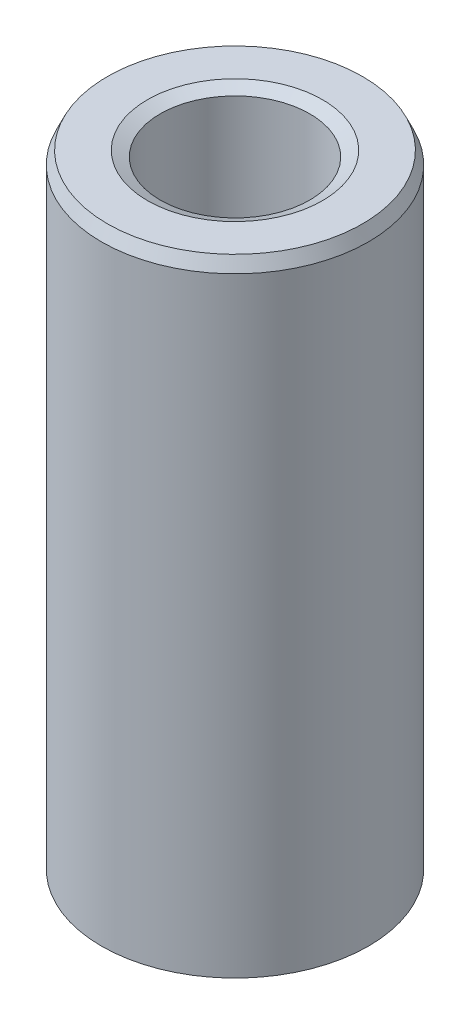
ISO-10303-21;
HEADER;
FILE_DESCRIPTION(('STEP AP214'),'2;1');
FILE_NAME('part.step','',(''),(''),'','','');
FILE_SCHEMA(('AUTOMOTIVE_DESIGN { 1 0 10303 214 1 1 1 1 }'));
ENDSEC;
DATA;
#1=APPLICATION_CONTEXT('core data for automotive mechanical design processes');
#2=APPLICATION_PROTOCOL_DEFINITION('international standard','automotive_design',2000,#1);
#3=PRODUCT_CONTEXT('',#1,'mechanical');
#4=PRODUCT('Part','Part','',(#3));
#5=PRODUCT_RELATED_PRODUCT_CATEGORY('part','',(#4));
#6=PRODUCT_DEFINITION_FORMATION('','',#4);
#7=PRODUCT_DEFINITION_CONTEXT('part definition',#1,'design');
#8=PRODUCT_DEFINITION('design','',#6,#7);
#9=PRODUCT_DEFINITION_SHAPE('','',#8);
#10=(LENGTH_UNIT() NAMED_UNIT(*) SI_UNIT(.MILLI.,.METRE.));
#11=(NAMED_UNIT(*) PLANE_ANGLE_UNIT() SI_UNIT($,.RADIAN.));
#12=(NAMED_UNIT(*) SI_UNIT($,.STERADIAN.) SOLID_ANGLE_UNIT());
#13=UNCERTAINTY_MEASURE_WITH_UNIT(LENGTH_MEASURE(1.E-05),#10,'distance_accuracy_value','');
#14=(GEOMETRIC_REPRESENTATION_CONTEXT(3) GLOBAL_UNCERTAINTY_ASSIGNED_CONTEXT((#13)) GLOBAL_UNIT_ASSIGNED_CONTEXT((#10,
#11,#12)) REPRESENTATION_CONTEXT('',''));
#15=CARTESIAN_POINT('',(0.,0.,0.));
#16=DIRECTION('',(0.,0.,1.));
#17=DIRECTION('',(1.,0.,0.));
#18=AXIS2_PLACEMENT_3D('',#15,#16,#17);
#19=CARTESIAN_POINT('',(0.,94.1859412438333,0.));
#20=DIRECTION('',(0.,-1.,0.));
#21=DIRECTION('',(0.,0.,-1.));
#22=AXIS2_PLACEMENT_3D('',#19,#20,#21);
#23=CYLINDRICAL_SURFACE('',#22,20.);
#24=CARTESIAN_POINT('',(0.,0.878231751337652,0.));
#25=DIRECTION('',(0.,1.,0.));
#26=DIRECTION('',(0.,0.,1.));
#27=AXIS2_PLACEMENT_3D('',#24,#25,#26);
#28=CIRCLE('',#27,20.);
#29=CARTESIAN_POINT('',(0.,0.878231751337652,20.));
#30=VERTEX_POINT('',#29);
#31=EDGE_CURVE('E10',#30,#30,#28,.T.);
#32=ORIENTED_EDGE('',*,*,#31,.T.);
#33=EDGE_LOOP('',(#32));
#34=FACE_BOUND('',#33,.T.);
#35=CARTESIAN_POINT('',(0.,92.2778141694954,0.));
#36=DIRECTION('',(0.,1.,0.));
#37=DIRECTION('',(0.,0.,1.));
#38=AXIS2_PLACEMENT_3D('',#35,#36,#37);
#39=CIRCLE('',#38,20.);
#40=CARTESIAN_POINT('',(0.,92.2778141694954,-20.));
#41=VERTEX_POINT('',#40);
#42=EDGE_CURVE('E50',#41,#41,#39,.F.);
#43=ORIENTED_EDGE('',*,*,#42,.T.);
#44=EDGE_LOOP('',(#43));
#45=FACE_BOUND('',#44,.T.);
#46=ADVANCED_FACE('F39',(#34,#45),#23,.T.);
#47=CARTESIAN_POINT('',(0.,94.1859412438333,0.));
#48=DIRECTION('',(0.,1.,0.));
#49=DIRECTION('',(0.,0.,1.));
#50=AXIS2_PLACEMENT_3D('',#47,#48,#49);
#51=PLANE('',#50);
#52=CARTESIAN_POINT('',(0.,94.1859412438333,0.));
#53=DIRECTION('',(0.,1.,0.));
#54=DIRECTION('',(0.,0.,1.));
#55=AXIS2_PLACEMENT_3D('',#52,#53,#54);
#56=CIRCLE('',#55,13.1146865611089);
#57=CARTESIAN_POINT('',(0.,94.1859412438333,13.1146865611089));
#58=VERTEX_POINT('',#57);
#59=EDGE_CURVE('E58',#58,#58,#56,.F.);
#60=ORIENTED_EDGE('',*,*,#59,.T.);
#61=EDGE_LOOP('',(#60));
#62=FACE_BOUND('',#61,.T.);
#63=CARTESIAN_POINT('',(0.,94.1859412438333,0.));
#64=DIRECTION('',(0.,1.,0.));
#65=DIRECTION('',(0.,0.,1.));
#66=AXIS2_PLACEMENT_3D('',#63,#64,#65);
#67=CIRCLE('',#66,19.1217682486623);
#68=CARTESIAN_POINT('',(0.,94.1859412438333,-19.1217682486623));
#69=VERTEX_POINT('',#68);
#70=EDGE_CURVE('E61',#69,#69,#67,.T.);
#71=ORIENTED_EDGE('',*,*,#70,.T.);
#72=EDGE_LOOP('',(#71));
#73=FACE_BOUND('',#72,.T.);
#74=ADVANCED_FACE('F88',(#62,#73),#51,.T.);
#75=CARTESIAN_POINT('',(0.,0.,0.));
#76=DIRECTION('',(0.,1.,0.));
#77=DIRECTION('',(0.,0.,1.));
#78=AXIS2_PLACEMENT_3D('',#75,#76,#77);
#79=PLANE('',#78);
#80=CARTESIAN_POINT('',(0.,0.,0.));
#81=DIRECTION('',(0.,1.,0.));
#82=DIRECTION('',(0.,0.,1.));
#83=AXIS2_PLACEMENT_3D('',#80,#81,#82);
#84=CIRCLE('',#83,12.0847912381087);
#85=CARTESIAN_POINT('',(0.,0.,12.0847912381087));
#86=VERTEX_POINT('',#85);
#87=EDGE_CURVE('E51',#86,#86,#84,.T.);
#88=ORIENTED_EDGE('',*,*,#87,.T.);
#89=EDGE_LOOP('',(#88));
#90=FACE_BOUND('',#89,.T.);
#91=CARTESIAN_POINT('',(0.,0.,0.));
#92=DIRECTION('',(0.,1.,0.));
#93=DIRECTION('',(0.,0.,1.));
#94=AXIS2_PLACEMENT_3D('',#91,#92,#93);
#95=CIRCLE('',#94,18.0918729256622);
#96=CARTESIAN_POINT('',(0.,0.,18.0918729256622));
#97=VERTEX_POINT('',#96);
#98=EDGE_CURVE('E54',#97,#97,#95,.F.);
#99=ORIENTED_EDGE('',*,*,#98,.T.);
#100=EDGE_LOOP('',(#99));
#101=FACE_BOUND('',#100,.T.);
#102=ADVANCED_FACE('F83',(#90,#101),#79,.F.);
#103=CARTESIAN_POINT('',(0.,94.1859412438333,0.));
#104=DIRECTION('',(0.,-1.,0.));
#105=DIRECTION('',(0.,0.,-1.));
#106=AXIS2_PLACEMENT_3D('',#103,#104,#105);
#107=CYLINDRICAL_SURFACE('',#106,11.206559486771);
#108=CARTESIAN_POINT('',(0.,93.3077094924957,0.));
#109=DIRECTION('',(0.,1.,0.));
#110=DIRECTION('',(0.,0.,1.));
#111=AXIS2_PLACEMENT_3D('',#108,#109,#110);
#112=CIRCLE('',#111,11.206559486771);
#113=CARTESIAN_POINT('',(0.,93.3077094924957,11.206559486771));
#114=VERTEX_POINT('',#113);
#115=EDGE_CURVE('E67',#114,#114,#112,.T.);
#116=ORIENTED_EDGE('',*,*,#115,.T.);
#117=EDGE_LOOP('',(#116));
#118=FACE_BOUND('',#117,.T.);
#119=CARTESIAN_POINT('',(0.,1.90812707433788,0.));
#120=DIRECTION('',(0.,1.,0.));
#121=DIRECTION('',(0.,0.,1.));
#122=AXIS2_PLACEMENT_3D('',#119,#120,#121);
#123=CIRCLE('',#122,11.206559486771);
#124=CARTESIAN_POINT('',(0.,1.90812707433788,11.206559486771));
#125=VERTEX_POINT('',#124);
#126=EDGE_CURVE('E69',#125,#125,#123,.F.);
#127=ORIENTED_EDGE('',*,*,#126,.T.);
#128=EDGE_LOOP('',(#127));
#129=FACE_BOUND('',#128,.T.);
#130=ADVANCED_FACE('F71',(#118,#129),#107,.F.);
#131=CARTESIAN_POINT('',(0.,93.3077094924957,0.));
#132=DIRECTION('',(0.,1.,0.));
#133=DIRECTION('',(0.,0.,1.));
#134=AXIS2_PLACEMENT_3D('',#131,#132,#133);
#135=CONICAL_SURFACE('',#134,11.206559486771,1.13944423275398);
#136=ORIENTED_EDGE('',*,*,#59,.F.);
#137=EDGE_LOOP('',(#136));
#138=FACE_BOUND('',#137,.T.);
#139=ORIENTED_EDGE('',*,*,#115,.F.);
#140=EDGE_LOOP('',(#139));
#141=FACE_BOUND('',#140,.T.);
#142=ADVANCED_FACE('F77',(#138,#141),#135,.F.);
#143=CARTESIAN_POINT('',(0.,0.,0.));
#144=DIRECTION('',(0.,-1.,0.));
#145=DIRECTION('',(0.,0.,-1.));
#146=AXIS2_PLACEMENT_3D('',#143,#144,#145);
#147=CONICAL_SURFACE('',#146,12.0847912381087,0.43135209404091);
#148=ORIENTED_EDGE('',*,*,#126,.F.);
#149=EDGE_LOOP('',(#148));
#150=FACE_BOUND('',#149,.T.);
#151=ORIENTED_EDGE('',*,*,#87,.F.);
#152=EDGE_LOOP('',(#151));
#153=FACE_BOUND('',#152,.T.);
#154=ADVANCED_FACE('F73',(#150,#153),#147,.F.);
#155=CARTESIAN_POINT('',(0.,0.878231751337652,0.));
#156=DIRECTION('',(0.,1.,0.));
#157=DIRECTION('',(0.,0.,1.));
#158=AXIS2_PLACEMENT_3D('',#155,#156,#157);
#159=CONICAL_SURFACE('',#158,20.,1.13944423275399);
#160=ORIENTED_EDGE('',*,*,#98,.F.);
#161=EDGE_LOOP('',(#160));
#162=FACE_BOUND('',#161,.T.);
#163=ORIENTED_EDGE('',*,*,#31,.F.);
#164=EDGE_LOOP('',(#163));
#165=FACE_BOUND('',#164,.T.);
#166=ADVANCED_FACE('F76',(#162,#165),#159,.T.);
#167=CARTESIAN_POINT('',(0.,94.1859412438333,0.));
#168=DIRECTION('',(0.,-1.,0.));
#169=DIRECTION('',(0.,0.,-1.));
#170=AXIS2_PLACEMENT_3D('',#167,#168,#169);
#171=CONICAL_SURFACE('',#170,19.1217682486623,0.431352094040906);
#172=CARTESIAN_POINT('',(0.,92.2778141694954,-20.));
#173=CARTESIAN_POINT('',(0.,92.2976904931864,-19.9908517525902));
#174=CARTESIAN_POINT('',(0.,92.3175668168775,-19.9817035051805));
#175=CARTESIAN_POINT('',(0.,92.3573194642595,-19.9634070103609));
#176=CARTESIAN_POINT('',(0.,92.3771957879505,-19.9542587629512));
#177=CARTESIAN_POINT('',(0.,92.4169484353326,-19.9359622681316));
#178=CARTESIAN_POINT('',(0.,92.4368247590236,-19.9268140207219));
#179=CARTESIAN_POINT('',(0.,92.4765774064056,-19.9085175259023));
#180=CARTESIAN_POINT('',(0.,92.4964537300966,-19.8993692784926));
#181=CARTESIAN_POINT('',(0.,92.5362063774787,-19.881072783673));
#182=CARTESIAN_POINT('',(0.,92.5560827011697,-19.8719245362633));
#183=CARTESIAN_POINT('',(0.,92.5958353485517,-19.8536280414437));
#184=CARTESIAN_POINT('',(0.,92.6157116722428,-19.844479794034));
#185=CARTESIAN_POINT('',(0.,92.6554643196248,-19.8261832992144));
#186=CARTESIAN_POINT('',(0.,92.6753406433158,-19.8170350518047));
#187=CARTESIAN_POINT('',(0.,92.7150932906979,-19.7987385569851));
#188=CARTESIAN_POINT('',(0.,92.7349696143889,-19.7895903095754));
#189=CARTESIAN_POINT('',(0.,92.7747222617709,-19.7712938147558));
#190=CARTESIAN_POINT('',(0.,92.7945985854619,-19.7621455673461));
#191=CARTESIAN_POINT('',(0.,92.834351232844,-19.7438490725265));
#192=CARTESIAN_POINT('',(0.,92.854227556535,-19.7347008251168));
#193=CARTESIAN_POINT('',(0.,92.893980203917,-19.7164043302972));
#194=CARTESIAN_POINT('',(0.,92.9138565276081,-19.7072560828875));
#195=CARTESIAN_POINT('',(0.,92.9536091749901,-19.6889595880679));
#196=CARTESIAN_POINT('',(0.,92.9734854986811,-19.6798113406581));
#197=CARTESIAN_POINT('',(0.,93.0132381460632,-19.6615148458386));
#198=CARTESIAN_POINT('',(0.,93.0331144697542,-19.6523665984288));
#199=CARTESIAN_POINT('',(0.,93.0728671171362,-19.6340701036093));
#200=CARTESIAN_POINT('',(0.,93.0927434408272,-19.6249218561995));
#201=CARTESIAN_POINT('',(0.,93.1324960882093,-19.60662536138));
#202=CARTESIAN_POINT('',(0.,93.1523724119003,-19.5974771139702));
#203=CARTESIAN_POINT('',(0.,93.1921250592823,-19.5791806191507));
#204=CARTESIAN_POINT('',(0.,93.2120013829734,-19.5700323717409));
#205=CARTESIAN_POINT('',(0.,93.2517540303554,-19.5517358769214));
#206=CARTESIAN_POINT('',(0.,93.2716303540464,-19.5425876295116));
#207=CARTESIAN_POINT('',(0.,93.3113830014285,-19.5242911346921));
#208=CARTESIAN_POINT('',(0.,93.3312593251195,-19.5151428872823));
#209=CARTESIAN_POINT('',(0.,93.3710119725015,-19.4968463924628));
#210=CARTESIAN_POINT('',(0.,93.3908882961925,-19.487698145053));
#211=CARTESIAN_POINT('',(0.,93.4306409435746,-19.4694016502335));
#212=CARTESIAN_POINT('',(0.,93.4505172672656,-19.4602534028237));
#213=CARTESIAN_POINT('',(0.,93.4902699146476,-19.4419569080042));
#214=CARTESIAN_POINT('',(0.,93.5101462383386,-19.4328086605944));
#215=CARTESIAN_POINT('',(0.,93.5498988857207,-19.4145121657749));
#216=CARTESIAN_POINT('',(0.,93.5697752094117,-19.4053639183651));
#217=CARTESIAN_POINT('',(0.,93.6095278567937,-19.3870674235456));
#218=CARTESIAN_POINT('',(0.,93.6294041804848,-19.3779191761358));
#219=CARTESIAN_POINT('',(0.,93.6691568278668,-19.3596226813163));
#220=CARTESIAN_POINT('',(0.,93.6890331515578,-19.3504744339065));
#221=CARTESIAN_POINT('',(0.,93.7287857989399,-19.332177939087));
#222=CARTESIAN_POINT('',(0.,93.7486621226309,-19.3230296916772));
#223=CARTESIAN_POINT('',(0.,93.7884147700129,-19.3047331968577));
#224=CARTESIAN_POINT('',(0.,93.8082910937039,-19.2955849494479));
#225=CARTESIAN_POINT('',(0.,93.848043741086,-19.2772884546284));
#226=CARTESIAN_POINT('',(0.,93.867920064777,-19.2681402072186));
#227=CARTESIAN_POINT('',(0.,93.907672712159,-19.2498437123991));
#228=CARTESIAN_POINT('',(0.,93.9275490358501,-19.2406954649893));
#229=CARTESIAN_POINT('',(0.,93.9673016832321,-19.2223989701698));
#230=CARTESIAN_POINT('',(0.,93.9871780069231,-19.21325072276));
#231=CARTESIAN_POINT('',(0.,94.0269306543052,-19.1949542279405));
#232=CARTESIAN_POINT('',(0.,94.0468069779962,-19.1858059805307));
#233=CARTESIAN_POINT('',(0.,94.0865596253782,-19.1675094857112));
#234=CARTESIAN_POINT('',(0.,94.1064359490692,-19.1583612383014));
#235=CARTESIAN_POINT('',(0.,94.1461885964513,-19.1400647434819));
#236=CARTESIAN_POINT('',(0.,94.1660649201423,-19.1309164960721));
#237=CARTESIAN_POINT('',(0.,94.1859412438333,-19.1217682486623));
#238=B_SPLINE_CURVE_WITH_KNOTS('',3,(#172,#173,#174,#175,#176,#177,#178,#179,#180,#181,#182,
#183,#184,#185,#186,#187,#188,#189,#190,#191,#192,#193,#194,#195,#196,#197,#198,#199,#200,#201,
#202,#203,#204,#205,#206,#207,#208,#209,#210,#211,#212,#213,#214,#215,#216,#217,#218,#219,#220,
#221,#222,#223,#224,#225,#226,#227,#228,#229,#230,#231,#232,#233,#234,#235,#236,#237),
.UNSPECIFIED.,.F.,.F.,(4,2,2,2,2,2,2,2,2,2,2,2,2,2,2,2,2,2,2,2,2,2,2,2,2,2,2,2,2,2,2,2,4),(0.,
0.0656416641110257,0.131283328222053,0.196924992333079,0.262566656444106,0.328208320555131,
0.393849984666159,0.459491648777172,0.525133312888199,0.590774976999225,0.656416641110252,
0.722058305221278,0.787699969332305,0.853341633443318,0.918983297554345,0.984624961665371,
1.0502666257764,1.11590828988742,1.18154995399845,1.24719161810948,1.31283328222049,
1.37847494633152,1.44411661044254,1.50975827455357,1.5753999386646,1.64104160277562,
1.70668326688664,1.77232493099766,1.83796659510869,1.90360825921972,1.96924992333074,
2.03489158744177,2.10053325155279),.UNSPECIFIED.);
#239=EDGE_CURVE('BSEAM45',#41,#69,#238,.T.);
#240=ORIENTED_EDGE('',*,*,#42,.F.);
#241=ORIENTED_EDGE('',*,*,#70,.F.);
#242=ORIENTED_EDGE('',*,*,#239,.T.);
#243=ORIENTED_EDGE('',*,*,#239,.F.);
#244=EDGE_LOOP('',(#240,#242,#241,#243));
#245=FACE_BOUND('',#244,.T.);
#246=ADVANCED_FACE('F45',(#245),#171,.T.);
#247=CLOSED_SHELL('',(#46,#74,#102,#130,#142,#154,#166,#246));
#248=MANIFOLD_SOLID_BREP('B2',#247);
#249=ADVANCED_BREP_SHAPE_REPRESENTATION('',(#18,#248),#14);
#250=SHAPE_DEFINITION_REPRESENTATION(#9,#249);
ENDSEC;
END-ISO-10303-21;
